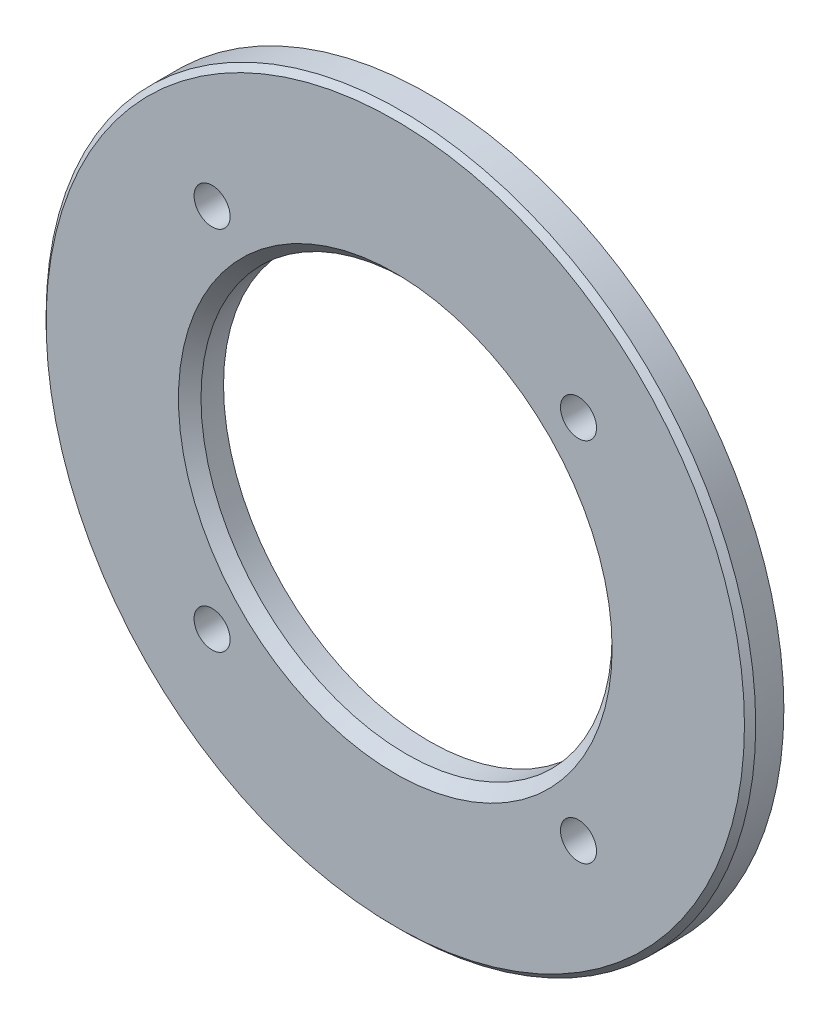
ISO-10303-21;
HEADER;
FILE_DESCRIPTION(('STEP AP214'),'2;1');
FILE_NAME('part.step','',(''),(''),'','','');
FILE_SCHEMA(('AUTOMOTIVE_DESIGN { 1 0 10303 214 1 1 1 1 }'));
ENDSEC;
DATA;
#1=APPLICATION_CONTEXT('core data for automotive mechanical design processes');
#2=APPLICATION_PROTOCOL_DEFINITION('international standard','automotive_design',2000,#1);
#3=PRODUCT_CONTEXT('',#1,'mechanical');
#4=PRODUCT('Part','Part','',(#3));
#5=PRODUCT_RELATED_PRODUCT_CATEGORY('part','',(#4));
#6=PRODUCT_DEFINITION_FORMATION('','',#4);
#7=PRODUCT_DEFINITION_CONTEXT('part definition',#1,'design');
#8=PRODUCT_DEFINITION('design','',#6,#7);
#9=PRODUCT_DEFINITION_SHAPE('','',#8);
#10=(LENGTH_UNIT() NAMED_UNIT(*) SI_UNIT(.MILLI.,.METRE.));
#11=(NAMED_UNIT(*) PLANE_ANGLE_UNIT() SI_UNIT($,.RADIAN.));
#12=(NAMED_UNIT(*) SI_UNIT($,.STERADIAN.) SOLID_ANGLE_UNIT());
#13=UNCERTAINTY_MEASURE_WITH_UNIT(LENGTH_MEASURE(1.E-05),#10,'distance_accuracy_value','');
#14=(GEOMETRIC_REPRESENTATION_CONTEXT(3) GLOBAL_UNCERTAINTY_ASSIGNED_CONTEXT((#13)) GLOBAL_UNIT_ASSIGNED_CONTEXT((#10,
#11,#12)) REPRESENTATION_CONTEXT('',''));
#15=CARTESIAN_POINT('',(0.,0.,0.));
#16=DIRECTION('',(0.,0.,1.));
#17=DIRECTION('',(1.,0.,0.));
#18=AXIS2_PLACEMENT_3D('',#15,#16,#17);
#19=CARTESIAN_POINT('',(0.,0.,3.));
#20=DIRECTION('',(0.,0.,1.));
#21=DIRECTION('',(1.,0.,0.));
#22=AXIS2_PLACEMENT_3D('',#19,#20,#21);
#23=PLANE('',#22);
#24=CARTESIAN_POINT('',(-16.2634559672905,16.2634559672907,3.));
#25=DIRECTION('',(0.,0.,-1.));
#26=DIRECTION('',(0.,-1.,0.));
#27=AXIS2_PLACEMENT_3D('',#24,#25,#26);
#28=CIRCLE('',#27,1.60000000000001);
#29=CARTESIAN_POINT('',(-16.2634559672905,14.6634559672907,3.));
#30=VERTEX_POINT('',#29);
#31=EDGE_CURVE('E75',#30,#30,#28,.T.);
#32=ORIENTED_EDGE('',*,*,#31,.T.);
#33=EDGE_LOOP('',(#32));
#34=FACE_BOUND('',#33,.T.);
#35=CARTESIAN_POINT('',(-16.2634559672905,-16.2634559672907,3.));
#36=DIRECTION('',(0.,0.,-1.));
#37=DIRECTION('',(1.,0.,0.));
#38=AXIS2_PLACEMENT_3D('',#35,#36,#37);
#39=CIRCLE('',#38,1.60000000000001);
#40=CARTESIAN_POINT('',(-14.6634559672905,-16.2634559672907,3.));
#41=VERTEX_POINT('',#40);
#42=EDGE_CURVE('E69',#41,#41,#39,.T.);
#43=ORIENTED_EDGE('',*,*,#42,.T.);
#44=EDGE_LOOP('',(#43));
#45=FACE_BOUND('',#44,.T.);
#46=CARTESIAN_POINT('',(16.2634559672906,-16.2634559672906,3.));
#47=DIRECTION('',(0.,0.,-1.));
#48=DIRECTION('',(0.,1.,0.));
#49=AXIS2_PLACEMENT_3D('',#46,#47,#48);
#50=CIRCLE('',#49,1.60000000000001);
#51=CARTESIAN_POINT('',(16.2634559672906,-14.6634559672906,3.));
#52=VERTEX_POINT('',#51);
#53=EDGE_CURVE('E63',#52,#52,#50,.T.);
#54=ORIENTED_EDGE('',*,*,#53,.T.);
#55=EDGE_LOOP('',(#54));
#56=FACE_BOUND('',#55,.T.);
#57=CARTESIAN_POINT('',(16.2634559672905,16.2634559672907,3.));
#58=DIRECTION('',(0.,0.,-1.));
#59=DIRECTION('',(-1.,0.,0.));
#60=AXIS2_PLACEMENT_3D('',#57,#58,#59);
#61=CIRCLE('',#60,1.60000000000001);
#62=CARTESIAN_POINT('',(14.6634559672905,16.2634559672907,3.));
#63=VERTEX_POINT('',#62);
#64=EDGE_CURVE('E59',#63,#63,#61,.T.);
#65=ORIENTED_EDGE('',*,*,#64,.T.);
#66=EDGE_LOOP('',(#65));
#67=FACE_BOUND('',#66,.T.);
#68=CARTESIAN_POINT('',(0.,0.,3.));
#69=DIRECTION('',(0.,0.,1.));
#70=DIRECTION('',(1.,0.,0.));
#71=AXIS2_PLACEMENT_3D('',#68,#69,#70);
#72=CIRCLE('',#71,31.);
#73=CARTESIAN_POINT('',(31.,0.,3.));
#74=VERTEX_POINT('',#73);
#75=EDGE_CURVE('E40',#74,#74,#72,.T.);
#76=ORIENTED_EDGE('',*,*,#75,.T.);
#77=EDGE_LOOP('',(#76));
#78=FACE_BOUND('',#77,.T.);
#79=CARTESIAN_POINT('',(0.,0.,3.));
#80=DIRECTION('',(0.,0.,1.));
#81=DIRECTION('',(1.,0.,0.));
#82=AXIS2_PLACEMENT_3D('',#79,#80,#81);
#83=CIRCLE('',#82,19.25);
#84=CARTESIAN_POINT('',(19.25,0.,3.));
#85=VERTEX_POINT('',#84);
#86=EDGE_CURVE('E44',#85,#85,#83,.F.);
#87=ORIENTED_EDGE('',*,*,#86,.T.);
#88=EDGE_LOOP('',(#87));
#89=FACE_BOUND('',#88,.T.);
#90=ADVANCED_FACE('F33',(#34,#45,#56,#67,#78,#89),#23,.T.);
#91=CARTESIAN_POINT('',(0.,0.,0.));
#92=DIRECTION('',(0.,0.,1.));
#93=DIRECTION('',(1.,0.,0.));
#94=AXIS2_PLACEMENT_3D('',#91,#92,#93);
#95=PLANE('',#94);
#96=CARTESIAN_POINT('',(-16.2634559672905,16.2634559672907,0.));
#97=DIRECTION('',(0.,0.,-1.));
#98=DIRECTION('',(0.,-1.,0.));
#99=AXIS2_PLACEMENT_3D('',#96,#97,#98);
#100=CIRCLE('',#99,1.60000000000001);
#101=CARTESIAN_POINT('',(-16.2634559672905,14.6634559672907,0.));
#102=VERTEX_POINT('',#101);
#103=EDGE_CURVE('E78',#102,#102,#100,.T.);
#104=ORIENTED_EDGE('',*,*,#103,.F.);
#105=EDGE_LOOP('',(#104));
#106=FACE_BOUND('',#105,.T.);
#107=CARTESIAN_POINT('',(-16.2634559672905,-16.2634559672907,0.));
#108=DIRECTION('',(0.,0.,-1.));
#109=DIRECTION('',(1.,0.,0.));
#110=AXIS2_PLACEMENT_3D('',#107,#108,#109);
#111=CIRCLE('',#110,1.60000000000001);
#112=CARTESIAN_POINT('',(-14.6634559672905,-16.2634559672907,0.));
#113=VERTEX_POINT('',#112);
#114=EDGE_CURVE('E72',#113,#113,#111,.T.);
#115=ORIENTED_EDGE('',*,*,#114,.F.);
#116=EDGE_LOOP('',(#115));
#117=FACE_BOUND('',#116,.T.);
#118=CARTESIAN_POINT('',(16.2634559672906,-16.2634559672906,0.));
#119=DIRECTION('',(0.,0.,-1.));
#120=DIRECTION('',(0.,1.,0.));
#121=AXIS2_PLACEMENT_3D('',#118,#119,#120);
#122=CIRCLE('',#121,1.60000000000001);
#123=CARTESIAN_POINT('',(16.2634559672906,-14.6634559672906,0.));
#124=VERTEX_POINT('',#123);
#125=EDGE_CURVE('E66',#124,#124,#122,.T.);
#126=ORIENTED_EDGE('',*,*,#125,.F.);
#127=EDGE_LOOP('',(#126));
#128=FACE_BOUND('',#127,.T.);
#129=CARTESIAN_POINT('',(16.2634559672905,16.2634559672907,0.));
#130=DIRECTION('',(0.,0.,-1.));
#131=DIRECTION('',(-1.,0.,0.));
#132=AXIS2_PLACEMENT_3D('',#129,#130,#131);
#133=CIRCLE('',#132,1.60000000000001);
#134=CARTESIAN_POINT('',(14.6634559672905,16.2634559672907,0.));
#135=VERTEX_POINT('',#134);
#136=EDGE_CURVE('E60',#135,#135,#133,.T.);
#137=ORIENTED_EDGE('',*,*,#136,.F.);
#138=EDGE_LOOP('',(#137));
#139=FACE_BOUND('',#138,.T.);
#140=CARTESIAN_POINT('',(0.,0.,0.));
#141=DIRECTION('',(0.,0.,1.));
#142=DIRECTION('',(1.,0.,0.));
#143=AXIS2_PLACEMENT_3D('',#140,#141,#142);
#144=CIRCLE('',#143,31.5);
#145=CARTESIAN_POINT('',(31.5,0.,0.));
#146=VERTEX_POINT('',#145);
#147=EDGE_CURVE('E53',#146,#146,#144,.T.);
#148=ORIENTED_EDGE('',*,*,#147,.F.);
#149=EDGE_LOOP('',(#148));
#150=FACE_BOUND('',#149,.T.);
#151=CARTESIAN_POINT('',(0.,0.,0.));
#152=DIRECTION('',(0.,0.,1.));
#153=DIRECTION('',(1.,0.,0.));
#154=AXIS2_PLACEMENT_3D('',#151,#152,#153);
#155=CIRCLE('',#154,18.25);
#156=CARTESIAN_POINT('',(18.25,0.,0.));
#157=VERTEX_POINT('',#156);
#158=EDGE_CURVE('E56',#157,#157,#155,.T.);
#159=ORIENTED_EDGE('',*,*,#158,.T.);
#160=EDGE_LOOP('',(#159));
#161=FACE_BOUND('',#160,.T.);
#162=ADVANCED_FACE('F93',(#106,#117,#128,#139,#150,#161),#95,.F.);
#163=CARTESIAN_POINT('',(0.,0.,3.));
#164=DIRECTION('',(0.,0.,-1.));
#165=DIRECTION('',(-1.,0.,0.));
#166=AXIS2_PLACEMENT_3D('',#163,#164,#165);
#167=CYLINDRICAL_SURFACE('',#166,31.5);
#168=CARTESIAN_POINT('',(0.,0.,2.50000000000001));
#169=DIRECTION('',(0.,0.,1.));
#170=DIRECTION('',(1.,0.,0.));
#171=AXIS2_PLACEMENT_3D('',#168,#169,#170);
#172=CIRCLE('',#171,31.5);
#173=CARTESIAN_POINT('',(31.5,0.,2.50000000000001));
#174=VERTEX_POINT('',#173);
#175=EDGE_CURVE('E10',#174,#174,#172,.F.);
#176=ORIENTED_EDGE('',*,*,#175,.T.);
#177=EDGE_LOOP('',(#176));
#178=FACE_BOUND('',#177,.T.);
#179=ORIENTED_EDGE('',*,*,#147,.T.);
#180=EDGE_LOOP('',(#179));
#181=FACE_BOUND('',#180,.T.);
#182=ADVANCED_FACE('F96',(#178,#181),#167,.T.);
#183=CARTESIAN_POINT('',(0.,0.,3.));
#184=DIRECTION('',(0.,0.,-1.));
#185=DIRECTION('',(-1.,0.,0.));
#186=AXIS2_PLACEMENT_3D('',#183,#184,#185);
#187=CYLINDRICAL_SURFACE('',#186,18.25);
#188=CARTESIAN_POINT('',(0.,0.,2.));
#189=DIRECTION('',(0.,0.,1.));
#190=DIRECTION('',(1.,0.,0.));
#191=AXIS2_PLACEMENT_3D('',#188,#189,#190);
#192=CIRCLE('',#191,18.25);
#193=CARTESIAN_POINT('',(18.25,0.,2.));
#194=VERTEX_POINT('',#193);
#195=EDGE_CURVE('E48',#194,#194,#192,.T.);
#196=ORIENTED_EDGE('',*,*,#195,.T.);
#197=EDGE_LOOP('',(#196));
#198=FACE_BOUND('',#197,.T.);
#199=ORIENTED_EDGE('',*,*,#158,.F.);
#200=EDGE_LOOP('',(#199));
#201=FACE_BOUND('',#200,.T.);
#202=ADVANCED_FACE('F108',(#198,#201),#187,.F.);
#203=CARTESIAN_POINT('',(0.,0.,2.));
#204=DIRECTION('',(0.,0.,1.));
#205=DIRECTION('',(1.,0.,0.));
#206=AXIS2_PLACEMENT_3D('',#203,#204,#205);
#207=CONICAL_SURFACE('',#206,18.25,0.785398163397452);
#208=ORIENTED_EDGE('',*,*,#86,.F.);
#209=EDGE_LOOP('',(#208));
#210=FACE_BOUND('',#209,.T.);
#211=ORIENTED_EDGE('',*,*,#195,.F.);
#212=EDGE_LOOP('',(#211));
#213=FACE_BOUND('',#212,.T.);
#214=ADVANCED_FACE('F110',(#210,#213),#207,.F.);
#215=CARTESIAN_POINT('',(0.,0.,3.));
#216=DIRECTION('',(0.,0.,-1.));
#217=DIRECTION('',(-1.,0.,0.));
#218=AXIS2_PLACEMENT_3D('',#215,#216,#217);
#219=CONICAL_SURFACE('',#218,31.,0.785398163397448);
#220=ORIENTED_EDGE('',*,*,#175,.F.);
#221=EDGE_LOOP('',(#220));
#222=FACE_BOUND('',#221,.T.);
#223=ORIENTED_EDGE('',*,*,#75,.F.);
#224=EDGE_LOOP('',(#223));
#225=FACE_BOUND('',#224,.T.);
#226=ADVANCED_FACE('F35',(#222,#225),#219,.T.);
#227=CARTESIAN_POINT('',(16.2634559672905,16.2634559672907,3.));
#228=DIRECTION('',(0.,0.,-1.));
#229=DIRECTION('',(-1.,0.,0.));
#230=AXIS2_PLACEMENT_3D('',#227,#228,#229);
#231=CYLINDRICAL_SURFACE('',#230,1.60000000000001);
#232=ORIENTED_EDGE('',*,*,#64,.F.);
#233=EDGE_LOOP('',(#232));
#234=FACE_BOUND('',#233,.T.);
#235=ORIENTED_EDGE('',*,*,#136,.T.);
#236=EDGE_LOOP('',(#235));
#237=FACE_BOUND('',#236,.T.);
#238=ADVANCED_FACE('F146',(#234,#237),#231,.F.);
#239=CARTESIAN_POINT('',(16.2634559672906,-16.2634559672906,3.));
#240=DIRECTION('',(0.,0.,-1.));
#241=DIRECTION('',(-1.,0.,0.));
#242=AXIS2_PLACEMENT_3D('',#239,#240,#241);
#243=CYLINDRICAL_SURFACE('',#242,1.60000000000001);
#244=ORIENTED_EDGE('',*,*,#53,.F.);
#245=EDGE_LOOP('',(#244));
#246=FACE_BOUND('',#245,.T.);
#247=ORIENTED_EDGE('',*,*,#125,.T.);
#248=EDGE_LOOP('',(#247));
#249=FACE_BOUND('',#248,.T.);
#250=ADVANCED_FACE('F154',(#246,#249),#243,.F.);
#251=CARTESIAN_POINT('',(-16.2634559672905,-16.2634559672907,3.));
#252=DIRECTION('',(0.,0.,-1.));
#253=DIRECTION('',(-1.,0.,0.));
#254=AXIS2_PLACEMENT_3D('',#251,#252,#253);
#255=CYLINDRICAL_SURFACE('',#254,1.60000000000001);
#256=ORIENTED_EDGE('',*,*,#42,.F.);
#257=EDGE_LOOP('',(#256));
#258=FACE_BOUND('',#257,.T.);
#259=ORIENTED_EDGE('',*,*,#114,.T.);
#260=EDGE_LOOP('',(#259));
#261=FACE_BOUND('',#260,.T.);
#262=ADVANCED_FACE('F89',(#258,#261),#255,.F.);
#263=CARTESIAN_POINT('',(-16.2634559672905,16.2634559672907,3.));
#264=DIRECTION('',(0.,0.,-1.));
#265=DIRECTION('',(-1.,0.,0.));
#266=AXIS2_PLACEMENT_3D('',#263,#264,#265);
#267=CYLINDRICAL_SURFACE('',#266,1.60000000000001);
#268=ORIENTED_EDGE('',*,*,#31,.F.);
#269=EDGE_LOOP('',(#268));
#270=FACE_BOUND('',#269,.T.);
#271=ORIENTED_EDGE('',*,*,#103,.T.);
#272=EDGE_LOOP('',(#271));
#273=FACE_BOUND('',#272,.T.);
#274=ADVANCED_FACE('F86',(#270,#273),#267,.F.);
#275=CLOSED_SHELL('',(#90,#162,#182,#202,#214,#226,#238,#250,#262,#274));
#276=MANIFOLD_SOLID_BREP('B2',#275);
#277=ADVANCED_BREP_SHAPE_REPRESENTATION('',(#18,#276),#14);
#278=SHAPE_DEFINITION_REPRESENTATION(#9,#277);
ENDSEC;
END-ISO-10303-21;
